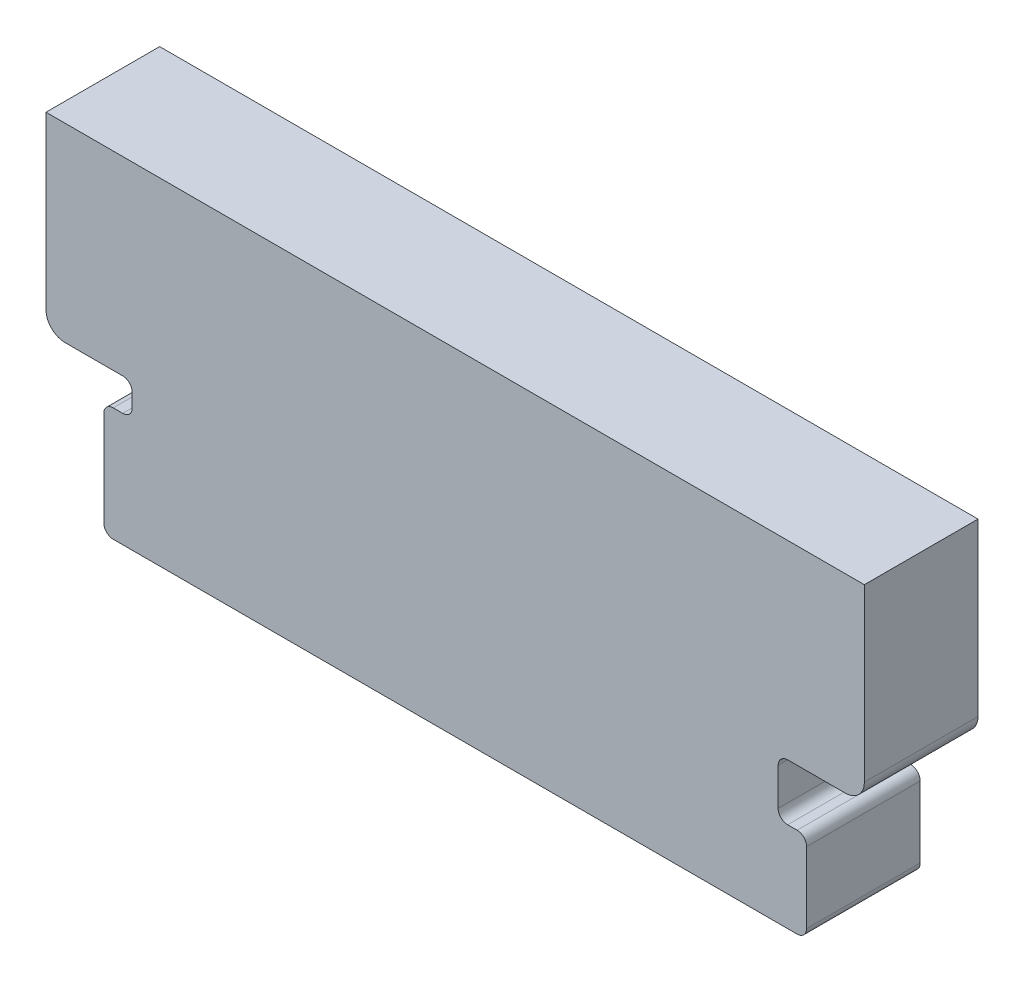
ISO-10303-21;
HEADER;
FILE_DESCRIPTION(('STEP AP214'),'2;1');
FILE_NAME('part.step','',(''),(''),'','','');
FILE_SCHEMA(('AUTOMOTIVE_DESIGN { 1 0 10303 214 1 1 1 1 }'));
ENDSEC;
DATA;
#1=APPLICATION_CONTEXT('core data for automotive mechanical design processes');
#2=APPLICATION_PROTOCOL_DEFINITION('international standard','automotive_design',2000,#1);
#3=PRODUCT_CONTEXT('',#1,'mechanical');
#4=PRODUCT('Part','Part','',(#3));
#5=PRODUCT_RELATED_PRODUCT_CATEGORY('part','',(#4));
#6=PRODUCT_DEFINITION_FORMATION('','',#4);
#7=PRODUCT_DEFINITION_CONTEXT('part definition',#1,'design');
#8=PRODUCT_DEFINITION('design','',#6,#7);
#9=PRODUCT_DEFINITION_SHAPE('','',#8);
#10=(LENGTH_UNIT() NAMED_UNIT(*) SI_UNIT(.MILLI.,.METRE.));
#11=(NAMED_UNIT(*) PLANE_ANGLE_UNIT() SI_UNIT($,.RADIAN.));
#12=(NAMED_UNIT(*) SI_UNIT($,.STERADIAN.) SOLID_ANGLE_UNIT());
#13=UNCERTAINTY_MEASURE_WITH_UNIT(LENGTH_MEASURE(1.E-05),#10,'distance_accuracy_value','');
#14=(GEOMETRIC_REPRESENTATION_CONTEXT(3) GLOBAL_UNCERTAINTY_ASSIGNED_CONTEXT((#13)) GLOBAL_UNIT_ASSIGNED_CONTEXT((#10,
#11,#12)) REPRESENTATION_CONTEXT('',''));
#15=CARTESIAN_POINT('',(0.,0.,0.));
#16=DIRECTION('',(0.,0.,1.));
#17=DIRECTION('',(1.,0.,0.));
#18=AXIS2_PLACEMENT_3D('',#15,#16,#17);
#19=CARTESIAN_POINT('',(-20.6,7.46042981658742,6.));
#20=DIRECTION('',(0.,0.,-1.));
#21=DIRECTION('',(-1.,0.,0.));
#22=AXIS2_PLACEMENT_3D('',#19,#20,#21);
#23=CYLINDRICAL_SURFACE('',#22,1.);
#24=CARTESIAN_POINT('',(-20.6,7.46042981658742,0.));
#25=DIRECTION('',(0.,0.,1.));
#26=DIRECTION('',(1.,0.,0.));
#27=AXIS2_PLACEMENT_3D('',#24,#25,#26);
#28=CIRCLE('',#27,1.);
#29=CARTESIAN_POINT('',(-21.6,7.46042981658742,0.));
#30=VERTEX_POINT('',#29);
#31=CARTESIAN_POINT('',(-20.6,6.46042981658742,0.));
#32=VERTEX_POINT('',#31);
#33=EDGE_CURVE('E219',#30,#32,#28,.T.);
#34=ORIENTED_EDGE('',*,*,#33,.T.);
#35=DIRECTION('',(0.,0.,-1.));
#36=VECTOR('',#35,1.);
#37=CARTESIAN_POINT('',(-20.6,6.46042981658742,6.));
#38=LINE('',#37,#36);
#39=CARTESIAN_POINT('',(-20.6,6.46042981658742,6.));
#40=VERTEX_POINT('',#39);
#41=EDGE_CURVE('E11',#40,#32,#38,.T.);
#42=ORIENTED_EDGE('',*,*,#41,.F.);
#43=CARTESIAN_POINT('',(-20.6,7.46042981658742,6.));
#44=DIRECTION('',(0.,0.,1.));
#45=DIRECTION('',(1.,0.,0.));
#46=AXIS2_PLACEMENT_3D('',#43,#44,#45);
#47=CIRCLE('',#46,1.);
#48=CARTESIAN_POINT('',(-21.6,7.46042981658742,6.));
#49=VERTEX_POINT('',#48);
#50=EDGE_CURVE('E261',#49,#40,#47,.T.);
#51=ORIENTED_EDGE('',*,*,#50,.F.);
#52=DIRECTION('',(0.,0.,-1.));
#53=VECTOR('',#52,1.);
#54=CARTESIAN_POINT('',(-21.6,7.46042981658742,6.));
#55=LINE('',#54,#53);
#56=EDGE_CURVE('E215',#49,#30,#55,.T.);
#57=ORIENTED_EDGE('',*,*,#56,.T.);
#58=EDGE_LOOP('',(#34,#42,#51,#57));
#59=FACE_BOUND('',#58,.T.);
#60=ADVANCED_FACE('F39',(#59),#23,.T.);
#61=CARTESIAN_POINT('',(-17.55,6.46042981658742,6.));
#62=DIRECTION('',(0.,1.,0.));
#63=DIRECTION('',(0.,0.,1.));
#64=AXIS2_PLACEMENT_3D('',#61,#62,#63);
#65=PLANE('',#64);
#66=DIRECTION('',(1.,0.,0.));
#67=VECTOR('',#66,1.);
#68=CARTESIAN_POINT('',(-17.55,6.46042981658742,0.));
#69=LINE('',#68,#67);
#70=CARTESIAN_POINT('',(-17.55,6.46042981658742,0.));
#71=VERTEX_POINT('',#70);
#72=EDGE_CURVE('E222',#32,#71,#69,.T.);
#73=ORIENTED_EDGE('',*,*,#72,.T.);
#74=DIRECTION('',(0.,0.,-1.));
#75=VECTOR('',#74,1.);
#76=CARTESIAN_POINT('',(-17.55,6.46042981658742,6.));
#77=LINE('',#76,#75);
#78=CARTESIAN_POINT('',(-17.55,6.46042981658742,6.));
#79=VERTEX_POINT('',#78);
#80=EDGE_CURVE('E47',#79,#71,#77,.T.);
#81=ORIENTED_EDGE('',*,*,#80,.F.);
#82=DIRECTION('',(1.,0.,0.));
#83=VECTOR('',#82,1.);
#84=CARTESIAN_POINT('',(-17.55,6.46042981658742,6.));
#85=LINE('',#84,#83);
#86=EDGE_CURVE('E140',#40,#79,#85,.T.);
#87=ORIENTED_EDGE('',*,*,#86,.F.);
#88=ORIENTED_EDGE('',*,*,#41,.T.);
#89=EDGE_LOOP('',(#73,#81,#87,#88));
#90=FACE_BOUND('',#89,.T.);
#91=ADVANCED_FACE('F389',(#90),#65,.F.);
#92=CARTESIAN_POINT('',(-17.55,5.96042981658742,6.));
#93=DIRECTION('',(0.,0.,-1.));
#94=DIRECTION('',(-1.,0.,0.));
#95=AXIS2_PLACEMENT_3D('',#92,#93,#94);
#96=CYLINDRICAL_SURFACE('',#95,0.5);
#97=CARTESIAN_POINT('',(-17.55,5.96042981658742,0.));
#98=DIRECTION('',(0.,0.,-1.));
#99=DIRECTION('',(-1.,0.,0.));
#100=AXIS2_PLACEMENT_3D('',#97,#98,#99);
#101=CIRCLE('',#100,0.5);
#102=CARTESIAN_POINT('',(-17.05,5.96042981658741,0.));
#103=VERTEX_POINT('',#102);
#104=EDGE_CURVE('E224',#71,#103,#101,.T.);
#105=ORIENTED_EDGE('',*,*,#104,.T.);
#106=DIRECTION('',(0.,0.,-1.));
#107=VECTOR('',#106,1.);
#108=CARTESIAN_POINT('',(-17.05,5.96042981658741,6.));
#109=LINE('',#108,#107);
#110=CARTESIAN_POINT('',(-17.05,5.96042981658741,6.));
#111=VERTEX_POINT('',#110);
#112=EDGE_CURVE('E310',#111,#103,#109,.T.);
#113=ORIENTED_EDGE('',*,*,#112,.F.);
#114=CARTESIAN_POINT('',(-17.55,5.96042981658742,6.));
#115=DIRECTION('',(0.,0.,-1.));
#116=DIRECTION('',(-1.,0.,0.));
#117=AXIS2_PLACEMENT_3D('',#114,#115,#116);
#118=CIRCLE('',#117,0.5);
#119=EDGE_CURVE('E318',#79,#111,#118,.T.);
#120=ORIENTED_EDGE('',*,*,#119,.F.);
#121=ORIENTED_EDGE('',*,*,#80,.T.);
#122=EDGE_LOOP('',(#105,#113,#120,#121));
#123=FACE_BOUND('',#122,.T.);
#124=ADVANCED_FACE('F316',(#123),#96,.F.);
#125=CARTESIAN_POINT('',(-17.05,5.25,6.));
#126=DIRECTION('',(1.,0.,0.));
#127=DIRECTION('',(0.,0.,-1.));
#128=AXIS2_PLACEMENT_3D('',#125,#126,#127);
#129=PLANE('',#128);
#130=DIRECTION('',(0.,-1.,0.));
#131=VECTOR('',#130,1.);
#132=CARTESIAN_POINT('',(-17.05,5.25,0.));
#133=LINE('',#132,#131);
#134=CARTESIAN_POINT('',(-17.05,5.25,0.));
#135=VERTEX_POINT('',#134);
#136=EDGE_CURVE('E226',#103,#135,#133,.T.);
#137=ORIENTED_EDGE('',*,*,#136,.T.);
#138=DIRECTION('',(0.,0.,-1.));
#139=VECTOR('',#138,1.);
#140=CARTESIAN_POINT('',(-17.05,5.25,6.));
#141=LINE('',#140,#139);
#142=CARTESIAN_POINT('',(-17.05,5.25,6.));
#143=VERTEX_POINT('',#142);
#144=EDGE_CURVE('E307',#143,#135,#141,.T.);
#145=ORIENTED_EDGE('',*,*,#144,.F.);
#146=DIRECTION('',(0.,-1.,0.));
#147=VECTOR('',#146,1.);
#148=CARTESIAN_POINT('',(-17.05,5.25,6.));
#149=LINE('',#148,#147);
#150=EDGE_CURVE('E336',#111,#143,#149,.T.);
#151=ORIENTED_EDGE('',*,*,#150,.F.);
#152=ORIENTED_EDGE('',*,*,#112,.T.);
#153=EDGE_LOOP('',(#137,#145,#151,#152));
#154=FACE_BOUND('',#153,.T.);
#155=ADVANCED_FACE('F327',(#154),#129,.F.);
#156=CARTESIAN_POINT('',(-17.55,5.24999999999999,6.));
#157=DIRECTION('',(0.,0.,-1.));
#158=DIRECTION('',(-1.,0.,0.));
#159=AXIS2_PLACEMENT_3D('',#156,#157,#158);
#160=CYLINDRICAL_SURFACE('',#159,0.5);
#161=CARTESIAN_POINT('',(-17.55,5.24999999999999,0.));
#162=DIRECTION('',(0.,0.,-1.));
#163=DIRECTION('',(-1.,0.,0.));
#164=AXIS2_PLACEMENT_3D('',#161,#162,#163);
#165=CIRCLE('',#164,0.5);
#166=CARTESIAN_POINT('',(-17.55,4.74999999999999,0.));
#167=VERTEX_POINT('',#166);
#168=EDGE_CURVE('E228',#135,#167,#165,.T.);
#169=ORIENTED_EDGE('',*,*,#168,.T.);
#170=DIRECTION('',(0.,0.,-1.));
#171=VECTOR('',#170,1.);
#172=CARTESIAN_POINT('',(-17.55,4.74999999999999,6.));
#173=LINE('',#172,#171);
#174=CARTESIAN_POINT('',(-17.55,4.74999999999999,6.));
#175=VERTEX_POINT('',#174);
#176=EDGE_CURVE('E304',#175,#167,#173,.T.);
#177=ORIENTED_EDGE('',*,*,#176,.F.);
#178=CARTESIAN_POINT('',(-17.55,5.24999999999999,6.));
#179=DIRECTION('',(0.,0.,-1.));
#180=DIRECTION('',(-1.,0.,0.));
#181=AXIS2_PLACEMENT_3D('',#178,#179,#180);
#182=CIRCLE('',#181,0.5);
#183=EDGE_CURVE('E333',#143,#175,#182,.T.);
#184=ORIENTED_EDGE('',*,*,#183,.F.);
#185=ORIENTED_EDGE('',*,*,#144,.T.);
#186=EDGE_LOOP('',(#169,#177,#184,#185));
#187=FACE_BOUND('',#186,.T.);
#188=ADVANCED_FACE('F331',(#187),#160,.F.);
#189=CARTESIAN_POINT('',(-18.05,4.74999999999999,6.));
#190=DIRECTION('',(0.,-1.,0.));
#191=DIRECTION('',(0.,0.,-1.));
#192=AXIS2_PLACEMENT_3D('',#189,#190,#191);
#193=PLANE('',#192);
#194=DIRECTION('',(-1.,0.,0.));
#195=VECTOR('',#194,1.);
#196=CARTESIAN_POINT('',(-18.05,4.74999999999999,0.));
#197=LINE('',#196,#195);
#198=CARTESIAN_POINT('',(-18.05,4.74999999999999,0.));
#199=VERTEX_POINT('',#198);
#200=EDGE_CURVE('E230',#167,#199,#197,.T.);
#201=ORIENTED_EDGE('',*,*,#200,.T.);
#202=DIRECTION('',(0.,0.,-1.));
#203=VECTOR('',#202,1.);
#204=CARTESIAN_POINT('',(-18.05,4.74999999999999,6.));
#205=LINE('',#204,#203);
#206=CARTESIAN_POINT('',(-18.05,4.74999999999999,6.));
#207=VERTEX_POINT('',#206);
#208=EDGE_CURVE('E301',#207,#199,#205,.T.);
#209=ORIENTED_EDGE('',*,*,#208,.F.);
#210=DIRECTION('',(-1.,0.,0.));
#211=VECTOR('',#210,1.);
#212=CARTESIAN_POINT('',(-18.05,4.74999999999999,6.));
#213=LINE('',#212,#211);
#214=EDGE_CURVE('E335',#175,#207,#213,.T.);
#215=ORIENTED_EDGE('',*,*,#214,.F.);
#216=ORIENTED_EDGE('',*,*,#176,.T.);
#217=EDGE_LOOP('',(#201,#209,#215,#216));
#218=FACE_BOUND('',#217,.T.);
#219=ADVANCED_FACE('F402',(#218),#193,.F.);
#220=CARTESIAN_POINT('',(-18.05,4.24999999999999,6.));
#221=DIRECTION('',(0.,0.,-1.));
#222=DIRECTION('',(-1.,0.,0.));
#223=AXIS2_PLACEMENT_3D('',#220,#221,#222);
#224=CYLINDRICAL_SURFACE('',#223,0.5);
#225=CARTESIAN_POINT('',(-18.05,4.24999999999999,0.));
#226=DIRECTION('',(0.,0.,1.));
#227=DIRECTION('',(1.,0.,0.));
#228=AXIS2_PLACEMENT_3D('',#225,#226,#227);
#229=CIRCLE('',#228,0.5);
#230=CARTESIAN_POINT('',(-18.55,4.24999999999999,0.));
#231=VERTEX_POINT('',#230);
#232=EDGE_CURVE('E232',#199,#231,#229,.T.);
#233=ORIENTED_EDGE('',*,*,#232,.T.);
#234=DIRECTION('',(0.,0.,-1.));
#235=VECTOR('',#234,1.);
#236=CARTESIAN_POINT('',(-18.55,4.24999999999999,6.));
#237=LINE('',#236,#235);
#238=CARTESIAN_POINT('',(-18.55,4.24999999999999,6.));
#239=VERTEX_POINT('',#238);
#240=EDGE_CURVE('E298',#239,#231,#237,.T.);
#241=ORIENTED_EDGE('',*,*,#240,.F.);
#242=CARTESIAN_POINT('',(-18.05,4.24999999999999,6.));
#243=DIRECTION('',(0.,0.,1.));
#244=DIRECTION('',(1.,0.,0.));
#245=AXIS2_PLACEMENT_3D('',#242,#243,#244);
#246=CIRCLE('',#245,0.5);
#247=EDGE_CURVE('E338',#207,#239,#246,.T.);
#248=ORIENTED_EDGE('',*,*,#247,.F.);
#249=ORIENTED_EDGE('',*,*,#208,.T.);
#250=EDGE_LOOP('',(#233,#241,#248,#249));
#251=FACE_BOUND('',#250,.T.);
#252=ADVANCED_FACE('F405',(#251),#224,.T.);
#253=CARTESIAN_POINT('',(-18.5499999999999,-0.759488517764659,6.));
#254=DIRECTION('',(1.,0.,0.));
#255=DIRECTION('',(0.,1.,0.));
#256=AXIS2_PLACEMENT_3D('',#253,#254,#255);
#257=PLANE('',#256);
#258=DIRECTION('',(0.,-1.,0.));
#259=VECTOR('',#258,1.);
#260=CARTESIAN_POINT('',(-18.5499999999999,-0.759488517764659,0.));
#261=LINE('',#260,#259);
#262=CARTESIAN_POINT('',(-18.5499999999999,-0.759488517764659,0.));
#263=VERTEX_POINT('',#262);
#264=EDGE_CURVE('E234',#231,#263,#261,.T.);
#265=ORIENTED_EDGE('',*,*,#264,.T.);
#266=DIRECTION('',(0.,0.,-1.));
#267=VECTOR('',#266,1.);
#268=CARTESIAN_POINT('',(-18.5499999999999,-0.759488517764659,6.));
#269=LINE('',#268,#267);
#270=CARTESIAN_POINT('',(-18.5499999999999,-0.759488517764659,6.));
#271=VERTEX_POINT('',#270);
#272=EDGE_CURVE('E295',#271,#263,#269,.T.);
#273=ORIENTED_EDGE('',*,*,#272,.F.);
#274=DIRECTION('',(0.,-1.,0.));
#275=VECTOR('',#274,1.);
#276=CARTESIAN_POINT('',(-18.5499999999999,-0.759488517764659,6.));
#277=LINE('',#276,#275);
#278=EDGE_CURVE('E344',#239,#271,#277,.T.);
#279=ORIENTED_EDGE('',*,*,#278,.F.);
#280=ORIENTED_EDGE('',*,*,#240,.T.);
#281=EDGE_LOOP('',(#265,#273,#279,#280));
#282=FACE_BOUND('',#281,.T.);
#283=ADVANCED_FACE('F409',(#282),#257,.F.);
#284=CARTESIAN_POINT('',(-18.0499999999999,-0.759488517764655,6.));
#285=DIRECTION('',(0.,0.,-1.));
#286=DIRECTION('',(-1.,0.,0.));
#287=AXIS2_PLACEMENT_3D('',#284,#285,#286);
#288=CYLINDRICAL_SURFACE('',#287,0.5);
#289=CARTESIAN_POINT('',(-18.0499999999999,-0.759488517764655,0.));
#290=DIRECTION('',(0.,0.,1.));
#291=DIRECTION('',(1.,0.,0.));
#292=AXIS2_PLACEMENT_3D('',#289,#290,#291);
#293=CIRCLE('',#292,0.5);
#294=CARTESIAN_POINT('',(-18.0499999999999,-1.25948851776465,0.));
#295=VERTEX_POINT('',#294);
#296=EDGE_CURVE('E236',#263,#295,#293,.T.);
#297=ORIENTED_EDGE('',*,*,#296,.T.);
#298=DIRECTION('',(0.,0.,-1.));
#299=VECTOR('',#298,1.);
#300=CARTESIAN_POINT('',(-18.0499999999999,-1.25948851776465,6.));
#301=LINE('',#300,#299);
#302=CARTESIAN_POINT('',(-18.0499999999999,-1.25948851776465,6.));
#303=VERTEX_POINT('',#302);
#304=EDGE_CURVE('E292',#303,#295,#301,.T.);
#305=ORIENTED_EDGE('',*,*,#304,.F.);
#306=CARTESIAN_POINT('',(-18.0499999999999,-0.759488517764655,6.));
#307=DIRECTION('',(0.,0.,1.));
#308=DIRECTION('',(1.,0.,0.));
#309=AXIS2_PLACEMENT_3D('',#306,#307,#308);
#310=CIRCLE('',#309,0.5);
#311=EDGE_CURVE('E346',#271,#303,#310,.T.);
#312=ORIENTED_EDGE('',*,*,#311,.F.);
#313=ORIENTED_EDGE('',*,*,#272,.T.);
#314=EDGE_LOOP('',(#297,#305,#312,#313));
#315=FACE_BOUND('',#314,.T.);
#316=ADVANCED_FACE('F413',(#315),#288,.T.);
#317=CARTESIAN_POINT('',(-18.0499999999999,-1.25948851776465,6.));
#318=DIRECTION('',(0.,1.,0.));
#319=DIRECTION('',(0.,0.,1.));
#320=AXIS2_PLACEMENT_3D('',#317,#318,#319);
#321=PLANE('',#320);
#322=DIRECTION('',(1.,0.,0.));
#323=VECTOR('',#322,1.);
#324=CARTESIAN_POINT('',(-18.0499999999999,-1.25948851776465,0.));
#325=LINE('',#324,#323);
#326=CARTESIAN_POINT('',(18.05,-1.25948851776465,0.));
#327=VERTEX_POINT('',#326);
#328=EDGE_CURVE('E238',#295,#327,#325,.T.);
#329=ORIENTED_EDGE('',*,*,#328,.T.);
#330=DIRECTION('',(0.,0.,-1.));
#331=VECTOR('',#330,1.);
#332=CARTESIAN_POINT('',(18.05,-1.25948851776465,6.));
#333=LINE('',#332,#331);
#334=CARTESIAN_POINT('',(18.05,-1.25948851776465,6.));
#335=VERTEX_POINT('',#334);
#336=EDGE_CURVE('E289',#335,#327,#333,.T.);
#337=ORIENTED_EDGE('',*,*,#336,.F.);
#338=DIRECTION('',(1.,0.,0.));
#339=VECTOR('',#338,1.);
#340=CARTESIAN_POINT('',(-18.0499999999999,-1.25948851776465,6.));
#341=LINE('',#340,#339);
#342=EDGE_CURVE('E348',#303,#335,#341,.T.);
#343=ORIENTED_EDGE('',*,*,#342,.F.);
#344=ORIENTED_EDGE('',*,*,#304,.T.);
#345=EDGE_LOOP('',(#329,#337,#343,#344));
#346=FACE_BOUND('',#345,.T.);
#347=ADVANCED_FACE('F417',(#346),#321,.F.);
#348=CARTESIAN_POINT('',(18.05,-0.759488517764655,6.));
#349=DIRECTION('',(0.,0.,-1.));
#350=DIRECTION('',(-1.,0.,0.));
#351=AXIS2_PLACEMENT_3D('',#348,#349,#350);
#352=CYLINDRICAL_SURFACE('',#351,0.499999999999999);
#353=CARTESIAN_POINT('',(18.05,-0.759488517764655,0.));
#354=DIRECTION('',(0.,0.,1.));
#355=DIRECTION('',(1.,0.,0.));
#356=AXIS2_PLACEMENT_3D('',#353,#354,#355);
#357=CIRCLE('',#356,0.499999999999999);
#358=CARTESIAN_POINT('',(18.55,-0.759488517764655,0.));
#359=VERTEX_POINT('',#358);
#360=EDGE_CURVE('E240',#327,#359,#357,.T.);
#361=ORIENTED_EDGE('',*,*,#360,.T.);
#362=DIRECTION('',(0.,0.,-1.));
#363=VECTOR('',#362,1.);
#364=CARTESIAN_POINT('',(18.55,-0.759488517764655,6.));
#365=LINE('',#364,#363);
#366=CARTESIAN_POINT('',(18.55,-0.759488517764655,6.));
#367=VERTEX_POINT('',#366);
#368=EDGE_CURVE('E286',#367,#359,#365,.T.);
#369=ORIENTED_EDGE('',*,*,#368,.F.);
#370=CARTESIAN_POINT('',(18.05,-0.759488517764655,6.));
#371=DIRECTION('',(0.,0.,1.));
#372=DIRECTION('',(1.,0.,0.));
#373=AXIS2_PLACEMENT_3D('',#370,#371,#372);
#374=CIRCLE('',#373,0.499999999999999);
#375=EDGE_CURVE('E350',#335,#367,#374,.T.);
#376=ORIENTED_EDGE('',*,*,#375,.F.);
#377=ORIENTED_EDGE('',*,*,#336,.T.);
#378=EDGE_LOOP('',(#361,#369,#376,#377));
#379=FACE_BOUND('',#378,.T.);
#380=ADVANCED_FACE('F421',(#379),#352,.T.);
#381=CARTESIAN_POINT('',(18.55,-0.759488517764655,6.));
#382=DIRECTION('',(-1.,0.,0.));
#383=DIRECTION('',(0.,0.,1.));
#384=AXIS2_PLACEMENT_3D('',#381,#382,#383);
#385=PLANE('',#384);
#386=DIRECTION('',(0.,1.,0.));
#387=VECTOR('',#386,1.);
#388=CARTESIAN_POINT('',(18.55,-0.759488517764655,0.));
#389=LINE('',#388,#387);
#390=CARTESIAN_POINT('',(18.55,2.99051148223535,0.));
#391=VERTEX_POINT('',#390);
#392=EDGE_CURVE('E242',#359,#391,#389,.T.);
#393=ORIENTED_EDGE('',*,*,#392,.T.);
#394=DIRECTION('',(0.,0.,-1.));
#395=VECTOR('',#394,1.);
#396=CARTESIAN_POINT('',(18.55,2.99051148223535,6.));
#397=LINE('',#396,#395);
#398=CARTESIAN_POINT('',(18.55,2.99051148223535,6.));
#399=VERTEX_POINT('',#398);
#400=EDGE_CURVE('E283',#399,#391,#397,.T.);
#401=ORIENTED_EDGE('',*,*,#400,.F.);
#402=DIRECTION('',(0.,1.,0.));
#403=VECTOR('',#402,1.);
#404=CARTESIAN_POINT('',(18.55,-0.759488517764655,6.));
#405=LINE('',#404,#403);
#406=EDGE_CURVE('E352',#367,#399,#405,.T.);
#407=ORIENTED_EDGE('',*,*,#406,.F.);
#408=ORIENTED_EDGE('',*,*,#368,.T.);
#409=EDGE_LOOP('',(#393,#401,#407,#408));
#410=FACE_BOUND('',#409,.T.);
#411=ADVANCED_FACE('F425',(#410),#385,.F.);
#412=CARTESIAN_POINT('',(18.05,2.99051148223535,6.));
#413=DIRECTION('',(0.,0.,-1.));
#414=DIRECTION('',(-1.,0.,0.));
#415=AXIS2_PLACEMENT_3D('',#412,#413,#414);
#416=CYLINDRICAL_SURFACE('',#415,0.5);
#417=CARTESIAN_POINT('',(18.05,2.99051148223535,0.));
#418=DIRECTION('',(0.,0.,1.));
#419=DIRECTION('',(1.,0.,0.));
#420=AXIS2_PLACEMENT_3D('',#417,#418,#419);
#421=CIRCLE('',#420,0.5);
#422=CARTESIAN_POINT('',(18.05,3.49051148223534,0.));
#423=VERTEX_POINT('',#422);
#424=EDGE_CURVE('E244',#391,#423,#421,.T.);
#425=ORIENTED_EDGE('',*,*,#424,.T.);
#426=DIRECTION('',(0.,0.,-1.));
#427=VECTOR('',#426,1.);
#428=CARTESIAN_POINT('',(18.05,3.49051148223534,6.));
#429=LINE('',#428,#427);
#430=CARTESIAN_POINT('',(18.05,3.49051148223534,6.));
#431=VERTEX_POINT('',#430);
#432=EDGE_CURVE('E280',#431,#423,#429,.T.);
#433=ORIENTED_EDGE('',*,*,#432,.F.);
#434=CARTESIAN_POINT('',(18.05,2.99051148223535,6.));
#435=DIRECTION('',(0.,0.,1.));
#436=DIRECTION('',(1.,0.,0.));
#437=AXIS2_PLACEMENT_3D('',#434,#435,#436);
#438=CIRCLE('',#437,0.5);
#439=EDGE_CURVE('E354',#399,#431,#438,.T.);
#440=ORIENTED_EDGE('',*,*,#439,.F.);
#441=ORIENTED_EDGE('',*,*,#400,.T.);
#442=EDGE_LOOP('',(#425,#433,#440,#441));
#443=FACE_BOUND('',#442,.T.);
#444=ADVANCED_FACE('F429',(#443),#416,.T.);
#445=CARTESIAN_POINT('',(18.05,3.49051148223534,6.));
#446=DIRECTION('',(0.,-1.,0.));
#447=DIRECTION('',(0.,0.,-1.));
#448=AXIS2_PLACEMENT_3D('',#445,#446,#447);
#449=PLANE('',#448);
#450=DIRECTION('',(-1.,0.,0.));
#451=VECTOR('',#450,1.);
#452=CARTESIAN_POINT('',(18.05,3.49051148223534,0.));
#453=LINE('',#452,#451);
#454=CARTESIAN_POINT('',(17.55,3.49051148223535,0.));
#455=VERTEX_POINT('',#454);
#456=EDGE_CURVE('E246',#423,#455,#453,.T.);
#457=ORIENTED_EDGE('',*,*,#456,.T.);
#458=DIRECTION('',(0.,0.,-1.));
#459=VECTOR('',#458,1.);
#460=CARTESIAN_POINT('',(17.55,3.49051148223535,6.));
#461=LINE('',#460,#459);
#462=CARTESIAN_POINT('',(17.55,3.49051148223535,6.));
#463=VERTEX_POINT('',#462);
#464=EDGE_CURVE('E277',#463,#455,#461,.T.);
#465=ORIENTED_EDGE('',*,*,#464,.F.);
#466=DIRECTION('',(-1.,0.,0.));
#467=VECTOR('',#466,1.);
#468=CARTESIAN_POINT('',(18.05,3.49051148223534,6.));
#469=LINE('',#468,#467);
#470=EDGE_CURVE('E356',#431,#463,#469,.T.);
#471=ORIENTED_EDGE('',*,*,#470,.F.);
#472=ORIENTED_EDGE('',*,*,#432,.T.);
#473=EDGE_LOOP('',(#457,#465,#471,#472));
#474=FACE_BOUND('',#473,.T.);
#475=ADVANCED_FACE('F433',(#474),#449,.F.);
#476=CARTESIAN_POINT('',(17.55,3.99051148223535,6.));
#477=DIRECTION('',(0.,0.,-1.));
#478=DIRECTION('',(-1.,0.,0.));
#479=AXIS2_PLACEMENT_3D('',#476,#477,#478);
#480=CYLINDRICAL_SURFACE('',#479,0.500000000000001);
#481=CARTESIAN_POINT('',(17.55,3.99051148223535,0.));
#482=DIRECTION('',(0.,0.,-1.));
#483=DIRECTION('',(-1.,0.,0.));
#484=AXIS2_PLACEMENT_3D('',#481,#482,#483);
#485=CIRCLE('',#484,0.500000000000001);
#486=CARTESIAN_POINT('',(17.05,3.99051148223535,0.));
#487=VERTEX_POINT('',#486);
#488=EDGE_CURVE('E248',#455,#487,#485,.T.);
#489=ORIENTED_EDGE('',*,*,#488,.T.);
#490=DIRECTION('',(0.,0.,-1.));
#491=VECTOR('',#490,1.);
#492=CARTESIAN_POINT('',(17.05,3.99051148223535,6.));
#493=LINE('',#492,#491);
#494=CARTESIAN_POINT('',(17.05,3.99051148223535,6.));
#495=VERTEX_POINT('',#494);
#496=EDGE_CURVE('E274',#495,#487,#493,.T.);
#497=ORIENTED_EDGE('',*,*,#496,.F.);
#498=CARTESIAN_POINT('',(17.55,3.99051148223535,6.));
#499=DIRECTION('',(0.,0.,-1.));
#500=DIRECTION('',(-1.,0.,0.));
#501=AXIS2_PLACEMENT_3D('',#498,#499,#500);
#502=CIRCLE('',#501,0.500000000000001);
#503=EDGE_CURVE('E358',#463,#495,#502,.T.);
#504=ORIENTED_EDGE('',*,*,#503,.F.);
#505=ORIENTED_EDGE('',*,*,#464,.T.);
#506=EDGE_LOOP('',(#489,#497,#504,#505));
#507=FACE_BOUND('',#506,.T.);
#508=ADVANCED_FACE('F437',(#507),#480,.F.);
#509=CARTESIAN_POINT('',(17.05,3.99051148223535,6.));
#510=DIRECTION('',(-1.,0.,0.));
#511=DIRECTION('',(0.,0.,1.));
#512=AXIS2_PLACEMENT_3D('',#509,#510,#511);
#513=PLANE('',#512);
#514=DIRECTION('',(0.,1.,0.));
#515=VECTOR('',#514,1.);
#516=CARTESIAN_POINT('',(17.05,3.99051148223535,0.));
#517=LINE('',#516,#515);
#518=CARTESIAN_POINT('',(17.05,5.96042981658742,0.));
#519=VERTEX_POINT('',#518);
#520=EDGE_CURVE('E250',#487,#519,#517,.T.);
#521=ORIENTED_EDGE('',*,*,#520,.T.);
#522=DIRECTION('',(0.,0.,-1.));
#523=VECTOR('',#522,1.);
#524=CARTESIAN_POINT('',(17.05,5.96042981658742,6.));
#525=LINE('',#524,#523);
#526=CARTESIAN_POINT('',(17.05,5.96042981658742,6.));
#527=VERTEX_POINT('',#526);
#528=EDGE_CURVE('E271',#527,#519,#525,.T.);
#529=ORIENTED_EDGE('',*,*,#528,.F.);
#530=DIRECTION('',(0.,1.,0.));
#531=VECTOR('',#530,1.);
#532=CARTESIAN_POINT('',(17.05,3.99051148223535,6.));
#533=LINE('',#532,#531);
#534=EDGE_CURVE('E360',#495,#527,#533,.T.);
#535=ORIENTED_EDGE('',*,*,#534,.F.);
#536=ORIENTED_EDGE('',*,*,#496,.T.);
#537=EDGE_LOOP('',(#521,#529,#535,#536));
#538=FACE_BOUND('',#537,.T.);
#539=ADVANCED_FACE('F441',(#538),#513,.F.);
#540=CARTESIAN_POINT('',(17.55,5.96042981658742,6.));
#541=DIRECTION('',(0.,0.,-1.));
#542=DIRECTION('',(-1.,0.,0.));
#543=AXIS2_PLACEMENT_3D('',#540,#541,#542);
#544=CYLINDRICAL_SURFACE('',#543,0.5);
#545=CARTESIAN_POINT('',(17.55,5.96042981658742,0.));
#546=DIRECTION('',(0.,0.,-1.));
#547=DIRECTION('',(-1.,0.,0.));
#548=AXIS2_PLACEMENT_3D('',#545,#546,#547);
#549=CIRCLE('',#548,0.5);
#550=CARTESIAN_POINT('',(17.55,6.46042981658742,0.));
#551=VERTEX_POINT('',#550);
#552=EDGE_CURVE('E252',#519,#551,#549,.T.);
#553=ORIENTED_EDGE('',*,*,#552,.T.);
#554=DIRECTION('',(0.,0.,-1.));
#555=VECTOR('',#554,1.);
#556=CARTESIAN_POINT('',(17.55,6.46042981658742,6.));
#557=LINE('',#556,#555);
#558=CARTESIAN_POINT('',(17.55,6.46042981658742,6.));
#559=VERTEX_POINT('',#558);
#560=EDGE_CURVE('E268',#559,#551,#557,.T.);
#561=ORIENTED_EDGE('',*,*,#560,.F.);
#562=CARTESIAN_POINT('',(17.55,5.96042981658742,6.));
#563=DIRECTION('',(0.,0.,-1.));
#564=DIRECTION('',(-1.,0.,0.));
#565=AXIS2_PLACEMENT_3D('',#562,#563,#564);
#566=CIRCLE('',#565,0.5);
#567=EDGE_CURVE('E362',#527,#559,#566,.T.);
#568=ORIENTED_EDGE('',*,*,#567,.F.);
#569=ORIENTED_EDGE('',*,*,#528,.T.);
#570=EDGE_LOOP('',(#553,#561,#568,#569));
#571=FACE_BOUND('',#570,.T.);
#572=ADVANCED_FACE('F445',(#571),#544,.F.);
#573=CARTESIAN_POINT('',(17.55,6.46042981658742,6.));
#574=DIRECTION('',(0.,1.,0.));
#575=DIRECTION('',(0.,0.,1.));
#576=AXIS2_PLACEMENT_3D('',#573,#574,#575);
#577=PLANE('',#576);
#578=DIRECTION('',(1.,0.,0.));
#579=VECTOR('',#578,1.);
#580=CARTESIAN_POINT('',(17.55,6.46042981658742,0.));
#581=LINE('',#580,#579);
#582=CARTESIAN_POINT('',(20.6,6.46042981658742,0.));
#583=VERTEX_POINT('',#582);
#584=EDGE_CURVE('E254',#551,#583,#581,.T.);
#585=ORIENTED_EDGE('',*,*,#584,.T.);
#586=DIRECTION('',(0.,0.,-1.));
#587=VECTOR('',#586,1.);
#588=CARTESIAN_POINT('',(20.6,6.46042981658742,6.));
#589=LINE('',#588,#587);
#590=CARTESIAN_POINT('',(20.6,6.46042981658742,6.));
#591=VERTEX_POINT('',#590);
#592=EDGE_CURVE('E265',#591,#583,#589,.T.);
#593=ORIENTED_EDGE('',*,*,#592,.F.);
#594=DIRECTION('',(1.,0.,0.));
#595=VECTOR('',#594,1.);
#596=CARTESIAN_POINT('',(17.55,6.46042981658742,6.));
#597=LINE('',#596,#595);
#598=EDGE_CURVE('E364',#559,#591,#597,.T.);
#599=ORIENTED_EDGE('',*,*,#598,.F.);
#600=ORIENTED_EDGE('',*,*,#560,.T.);
#601=EDGE_LOOP('',(#585,#593,#599,#600));
#602=FACE_BOUND('',#601,.T.);
#603=ADVANCED_FACE('F370',(#602),#577,.F.);
#604=CARTESIAN_POINT('',(20.6,7.46042981658742,6.));
#605=DIRECTION('',(0.,0.,-1.));
#606=DIRECTION('',(-1.,0.,0.));
#607=AXIS2_PLACEMENT_3D('',#604,#605,#606);
#608=CYLINDRICAL_SURFACE('',#607,1.);
#609=CARTESIAN_POINT('',(20.6,7.46042981658742,0.));
#610=DIRECTION('',(0.,0.,1.));
#611=DIRECTION('',(1.,0.,0.));
#612=AXIS2_PLACEMENT_3D('',#609,#610,#611);
#613=CIRCLE('',#612,1.);
#614=CARTESIAN_POINT('',(21.6,7.46042981658743,0.));
#615=VERTEX_POINT('',#614);
#616=EDGE_CURVE('E256',#583,#615,#613,.T.);
#617=ORIENTED_EDGE('',*,*,#616,.T.);
#618=DIRECTION('',(0.,0.,-1.));
#619=VECTOR('',#618,1.);
#620=CARTESIAN_POINT('',(21.6,7.46042981658743,6.));
#621=LINE('',#620,#619);
#622=CARTESIAN_POINT('',(21.6,7.46042981658743,6.));
#623=VERTEX_POINT('',#622);
#624=EDGE_CURVE('E210',#623,#615,#621,.T.);
#625=ORIENTED_EDGE('',*,*,#624,.F.);
#626=CARTESIAN_POINT('',(20.6,7.46042981658742,6.));
#627=DIRECTION('',(0.,0.,1.));
#628=DIRECTION('',(1.,0.,0.));
#629=AXIS2_PLACEMENT_3D('',#626,#627,#628);
#630=CIRCLE('',#629,1.);
#631=EDGE_CURVE('E201',#591,#623,#630,.T.);
#632=ORIENTED_EDGE('',*,*,#631,.F.);
#633=ORIENTED_EDGE('',*,*,#592,.T.);
#634=EDGE_LOOP('',(#617,#625,#632,#633));
#635=FACE_BOUND('',#634,.T.);
#636=ADVANCED_FACE('F374',(#635),#608,.T.);
#637=CARTESIAN_POINT('',(21.6,7.46042981658743,6.));
#638=DIRECTION('',(-1.,0.,0.));
#639=DIRECTION('',(0.,0.,1.));
#640=AXIS2_PLACEMENT_3D('',#637,#638,#639);
#641=PLANE('',#640);
#642=DIRECTION('',(0.,1.,0.));
#643=VECTOR('',#642,1.);
#644=CARTESIAN_POINT('',(21.6,7.46042981658743,0.));
#645=LINE('',#644,#643);
#646=CARTESIAN_POINT('',(21.6,16.4905114822354,0.));
#647=VERTEX_POINT('',#646);
#648=EDGE_CURVE('E209',#615,#647,#645,.T.);
#649=ORIENTED_EDGE('',*,*,#648,.T.);
#650=DIRECTION('',(0.,0.,-1.));
#651=VECTOR('',#650,1.);
#652=CARTESIAN_POINT('',(21.6,16.4905114822354,6.));
#653=LINE('',#652,#651);
#654=CARTESIAN_POINT('',(21.6,16.4905114822354,6.));
#655=VERTEX_POINT('',#654);
#656=EDGE_CURVE('E206',#655,#647,#653,.T.);
#657=ORIENTED_EDGE('',*,*,#656,.F.);
#658=DIRECTION('',(0.,1.,0.));
#659=VECTOR('',#658,1.);
#660=CARTESIAN_POINT('',(21.6,7.46042981658743,6.));
#661=LINE('',#660,#659);
#662=EDGE_CURVE('E195',#623,#655,#661,.T.);
#663=ORIENTED_EDGE('',*,*,#662,.F.);
#664=ORIENTED_EDGE('',*,*,#624,.T.);
#665=EDGE_LOOP('',(#649,#657,#663,#664));
#666=FACE_BOUND('',#665,.T.);
#667=ADVANCED_FACE('F207',(#666),#641,.F.);
#668=CARTESIAN_POINT('',(21.6,16.4905114822354,6.));
#669=DIRECTION('',(0.,-1.,0.));
#670=DIRECTION('',(1.,0.,0.));
#671=AXIS2_PLACEMENT_3D('',#668,#669,#670);
#672=PLANE('',#671);
#673=DIRECTION('',(-1.,0.,0.));
#674=VECTOR('',#673,1.);
#675=CARTESIAN_POINT('',(21.6,16.4905114822354,0.));
#676=LINE('',#675,#674);
#677=CARTESIAN_POINT('',(-21.5999999999999,16.4905114822353,0.));
#678=VERTEX_POINT('',#677);
#679=EDGE_CURVE('E126',#647,#678,#676,.T.);
#680=ORIENTED_EDGE('',*,*,#679,.T.);
#681=DIRECTION('',(0.,0.,-1.));
#682=VECTOR('',#681,1.);
#683=CARTESIAN_POINT('',(-21.5999999999999,16.4905114822353,6.));
#684=LINE('',#683,#682);
#685=CARTESIAN_POINT('',(-21.5999999999999,16.4905114822353,6.));
#686=VERTEX_POINT('',#685);
#687=EDGE_CURVE('E211',#686,#678,#684,.T.);
#688=ORIENTED_EDGE('',*,*,#687,.F.);
#689=DIRECTION('',(-1.,0.,0.));
#690=VECTOR('',#689,1.);
#691=CARTESIAN_POINT('',(21.6,16.4905114822354,6.));
#692=LINE('',#691,#690);
#693=EDGE_CURVE('E199',#655,#686,#692,.T.);
#694=ORIENTED_EDGE('',*,*,#693,.F.);
#695=ORIENTED_EDGE('',*,*,#656,.T.);
#696=EDGE_LOOP('',(#680,#688,#694,#695));
#697=FACE_BOUND('',#696,.T.);
#698=ADVANCED_FACE('F213',(#697),#672,.F.);
#699=CARTESIAN_POINT('',(-21.6,7.46042981658742,6.));
#700=DIRECTION('',(1.,0.,0.));
#701=DIRECTION('',(0.,1.,0.));
#702=AXIS2_PLACEMENT_3D('',#699,#700,#701);
#703=PLANE('',#702);
#704=DIRECTION('',(0.,-1.,0.));
#705=VECTOR('',#704,1.);
#706=CARTESIAN_POINT('',(-21.6,7.46042981658742,0.));
#707=LINE('',#706,#705);
#708=EDGE_CURVE('E132',#678,#30,#707,.T.);
#709=ORIENTED_EDGE('',*,*,#708,.T.);
#710=ORIENTED_EDGE('',*,*,#56,.F.);
#711=DIRECTION('',(0.,-1.,0.));
#712=VECTOR('',#711,1.);
#713=CARTESIAN_POINT('',(-21.6,7.46042981658742,6.));
#714=LINE('',#713,#712);
#715=EDGE_CURVE('E55',#686,#49,#714,.T.);
#716=ORIENTED_EDGE('',*,*,#715,.F.);
#717=ORIENTED_EDGE('',*,*,#687,.T.);
#718=EDGE_LOOP('',(#709,#710,#716,#717));
#719=FACE_BOUND('',#718,.T.);
#720=ADVANCED_FACE('F378',(#719),#703,.F.);
#721=CARTESIAN_POINT('',(-20.6,7.46042981658742,6.));
#722=DIRECTION('',(0.,0.,1.));
#723=DIRECTION('',(1.,0.,0.));
#724=AXIS2_PLACEMENT_3D('',#721,#722,#723);
#725=PLANE('',#724);
#726=ORIENTED_EDGE('',*,*,#50,.T.);
#727=ORIENTED_EDGE('',*,*,#86,.T.);
#728=ORIENTED_EDGE('',*,*,#119,.T.);
#729=ORIENTED_EDGE('',*,*,#150,.T.);
#730=ORIENTED_EDGE('',*,*,#183,.T.);
#731=ORIENTED_EDGE('',*,*,#214,.T.);
#732=ORIENTED_EDGE('',*,*,#247,.T.);
#733=ORIENTED_EDGE('',*,*,#278,.T.);
#734=ORIENTED_EDGE('',*,*,#311,.T.);
#735=ORIENTED_EDGE('',*,*,#342,.T.);
#736=ORIENTED_EDGE('',*,*,#375,.T.);
#737=ORIENTED_EDGE('',*,*,#406,.T.);
#738=ORIENTED_EDGE('',*,*,#439,.T.);
#739=ORIENTED_EDGE('',*,*,#470,.T.);
#740=ORIENTED_EDGE('',*,*,#503,.T.);
#741=ORIENTED_EDGE('',*,*,#534,.T.);
#742=ORIENTED_EDGE('',*,*,#567,.T.);
#743=ORIENTED_EDGE('',*,*,#598,.T.);
#744=ORIENTED_EDGE('',*,*,#631,.T.);
#745=ORIENTED_EDGE('',*,*,#662,.T.);
#746=ORIENTED_EDGE('',*,*,#693,.T.);
#747=ORIENTED_EDGE('',*,*,#715,.T.);
#748=EDGE_LOOP('',(#726,#727,#728,#729,#730,#731,#732,#733,#734,#735,#736,#737,#738,#739,#740,
#741,#742,#743,#744,#745,#746,#747));
#749=FACE_BOUND('',#748,.T.);
#750=ADVANCED_FACE('F197',(#749),#725,.T.);
#751=CARTESIAN_POINT('',(-20.6,7.46042981658742,0.));
#752=DIRECTION('',(0.,0.,1.));
#753=DIRECTION('',(1.,0.,0.));
#754=AXIS2_PLACEMENT_3D('',#751,#752,#753);
#755=PLANE('',#754);
#756=ORIENTED_EDGE('',*,*,#33,.F.);
#757=ORIENTED_EDGE('',*,*,#708,.F.);
#758=ORIENTED_EDGE('',*,*,#679,.F.);
#759=ORIENTED_EDGE('',*,*,#648,.F.);
#760=ORIENTED_EDGE('',*,*,#616,.F.);
#761=ORIENTED_EDGE('',*,*,#584,.F.);
#762=ORIENTED_EDGE('',*,*,#552,.F.);
#763=ORIENTED_EDGE('',*,*,#520,.F.);
#764=ORIENTED_EDGE('',*,*,#488,.F.);
#765=ORIENTED_EDGE('',*,*,#456,.F.);
#766=ORIENTED_EDGE('',*,*,#424,.F.);
#767=ORIENTED_EDGE('',*,*,#392,.F.);
#768=ORIENTED_EDGE('',*,*,#360,.F.);
#769=ORIENTED_EDGE('',*,*,#328,.F.);
#770=ORIENTED_EDGE('',*,*,#296,.F.);
#771=ORIENTED_EDGE('',*,*,#264,.F.);
#772=ORIENTED_EDGE('',*,*,#232,.F.);
#773=ORIENTED_EDGE('',*,*,#200,.F.);
#774=ORIENTED_EDGE('',*,*,#168,.F.);
#775=ORIENTED_EDGE('',*,*,#136,.F.);
#776=ORIENTED_EDGE('',*,*,#104,.F.);
#777=ORIENTED_EDGE('',*,*,#72,.F.);
#778=EDGE_LOOP('',(#756,#757,#758,#759,#760,#761,#762,#763,#764,#765,#766,#767,#768,#769,#770,
#771,#772,#773,#774,#775,#776,#777));
#779=FACE_BOUND('',#778,.T.);
#780=ADVANCED_FACE('F322',(#779),#755,.F.);
#781=CLOSED_SHELL('',(#60,#91,#124,#155,#188,#219,#252,#283,#316,#347,#380,#411,#444,#475,#508,
#539,#572,#603,#636,#667,#698,#720,#750,#780));
#782=MANIFOLD_SOLID_BREP('B2',#781);
#783=ADVANCED_BREP_SHAPE_REPRESENTATION('',(#18,#782),#14);
#784=SHAPE_DEFINITION_REPRESENTATION(#9,#783);
ENDSEC;
END-ISO-10303-21;
